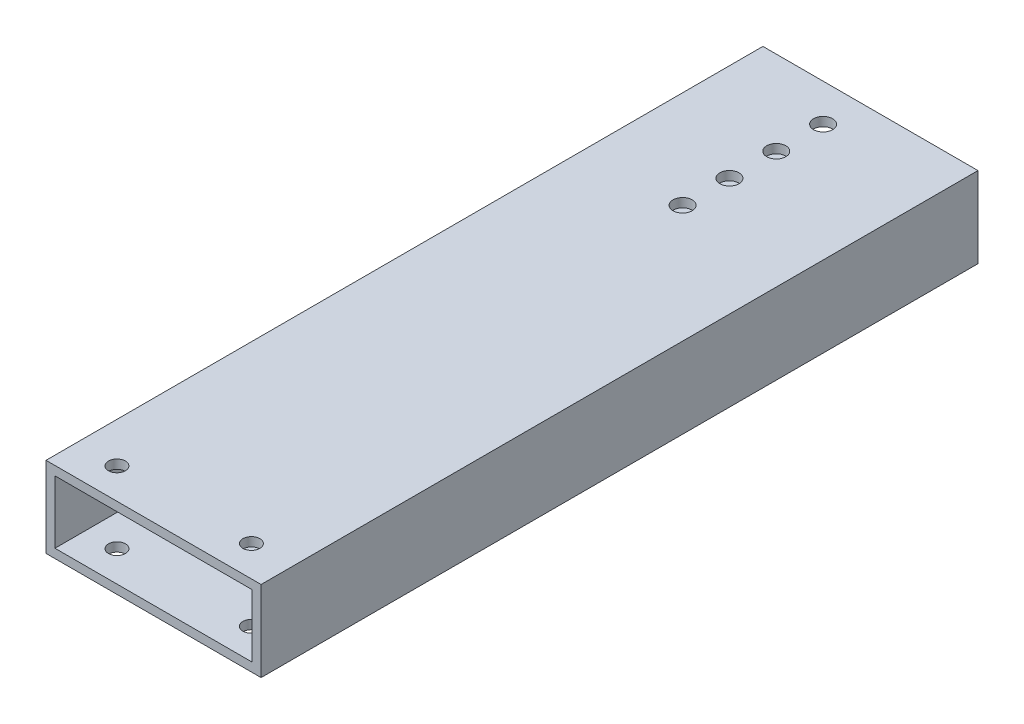
ISO-10303-21;
HEADER;
FILE_DESCRIPTION(('STEP AP214'),'2;1');
FILE_NAME('part.step','',(''),(''),'','','');
FILE_SCHEMA(('AUTOMOTIVE_DESIGN { 1 0 10303 214 1 1 1 1 }'));
ENDSEC;
DATA;
#1=APPLICATION_CONTEXT('core data for automotive mechanical design processes');
#2=APPLICATION_PROTOCOL_DEFINITION('international standard','automotive_design',2000,#1);
#3=PRODUCT_CONTEXT('',#1,'mechanical');
#4=PRODUCT('Part','Part','',(#3));
#5=PRODUCT_RELATED_PRODUCT_CATEGORY('part','',(#4));
#6=PRODUCT_DEFINITION_FORMATION('','',#4);
#7=PRODUCT_DEFINITION_CONTEXT('part definition',#1,'design');
#8=PRODUCT_DEFINITION('design','',#6,#7);
#9=PRODUCT_DEFINITION_SHAPE('','',#8);
#10=(LENGTH_UNIT() NAMED_UNIT(*) SI_UNIT(.MILLI.,.METRE.));
#11=(NAMED_UNIT(*) PLANE_ANGLE_UNIT() SI_UNIT($,.RADIAN.));
#12=(NAMED_UNIT(*) SI_UNIT($,.STERADIAN.) SOLID_ANGLE_UNIT());
#13=UNCERTAINTY_MEASURE_WITH_UNIT(LENGTH_MEASURE(1.E-05),#10,'distance_accuracy_value','');
#14=(GEOMETRIC_REPRESENTATION_CONTEXT(3) GLOBAL_UNCERTAINTY_ASSIGNED_CONTEXT((#13)) GLOBAL_UNIT_ASSIGNED_CONTEXT((#10,
#11,#12)) REPRESENTATION_CONTEXT('',''));
#15=CARTESIAN_POINT('',(0.,0.,0.));
#16=DIRECTION('',(0.,0.,1.));
#17=DIRECTION('',(1.,0.,0.));
#18=AXIS2_PLACEMENT_3D('',#15,#16,#17);
#19=CARTESIAN_POINT('',(3.175,28.575,-254.));
#20=DIRECTION('',(-1.,0.,0.));
#21=DIRECTION('',(0.,0.,1.));
#22=AXIS2_PLACEMENT_3D('',#19,#20,#21);
#23=PLANE('',#22);
#24=DIRECTION('',(0.,0.,-1.));
#25=VECTOR('',#24,1.);
#26=CARTESIAN_POINT('',(3.17500000000003,25.4,0.));
#27=LINE('',#26,#25);
#28=CARTESIAN_POINT('',(3.17500000000003,25.4,0.));
#29=VERTEX_POINT('',#28);
#30=CARTESIAN_POINT('',(3.175,25.4,-254.));
#31=VERTEX_POINT('',#30);
#32=EDGE_CURVE('E114',#29,#31,#27,.T.);
#33=ORIENTED_EDGE('',*,*,#32,.F.);
#34=DIRECTION('',(0.,-1.,0.));
#35=VECTOR('',#34,1.);
#36=CARTESIAN_POINT('',(3.17500000000003,28.575,0.));
#37=LINE('',#36,#35);
#38=CARTESIAN_POINT('',(3.17500000000002,3.175,0.));
#39=VERTEX_POINT('',#38);
#40=EDGE_CURVE('E57',#29,#39,#37,.T.);
#41=ORIENTED_EDGE('',*,*,#40,.T.);
#42=DIRECTION('',(0.,0.,-1.));
#43=VECTOR('',#42,1.);
#44=CARTESIAN_POINT('',(3.175,3.175,-254.));
#45=LINE('',#44,#43);
#46=CARTESIAN_POINT('',(3.175,3.175,-254.));
#47=VERTEX_POINT('',#46);
#48=EDGE_CURVE('E119',#39,#47,#45,.T.);
#49=ORIENTED_EDGE('',*,*,#48,.T.);
#50=DIRECTION('',(0.,-1.,0.));
#51=VECTOR('',#50,1.);
#52=CARTESIAN_POINT('',(3.175,28.575,-254.));
#53=LINE('',#52,#51);
#54=EDGE_CURVE('E108',#31,#47,#53,.T.);
#55=ORIENTED_EDGE('',*,*,#54,.F.);
#56=EDGE_LOOP('',(#33,#41,#49,#55));
#57=FACE_BOUND('',#56,.T.);
#58=ADVANCED_FACE('F32',(#57),#23,.F.);
#59=CARTESIAN_POINT('',(73.025,28.575,0.));
#60=DIRECTION('',(1.,0.,0.));
#61=DIRECTION('',(0.,0.,-1.));
#62=AXIS2_PLACEMENT_3D('',#59,#60,#61);
#63=PLANE('',#62);
#64=DIRECTION('',(0.,0.,-1.));
#65=VECTOR('',#64,1.);
#66=CARTESIAN_POINT('',(73.0249999999728,25.4,-6.14669686828047E-11));
#67=LINE('',#66,#65);
#68=CARTESIAN_POINT('',(73.0250000000865,25.4,0.));
#69=VERTEX_POINT('',#68);
#70=CARTESIAN_POINT('',(73.0250000000865,25.4,-254.));
#71=VERTEX_POINT('',#70);
#72=EDGE_CURVE('E214',#69,#71,#67,.T.);
#73=ORIENTED_EDGE('',*,*,#72,.T.);
#74=DIRECTION('',(0.,-1.,0.));
#75=VECTOR('',#74,1.);
#76=CARTESIAN_POINT('',(73.025,28.575,-254.));
#77=LINE('',#76,#75);
#78=CARTESIAN_POINT('',(73.025,3.175,-254.));
#79=VERTEX_POINT('',#78);
#80=EDGE_CURVE('E110',#71,#79,#77,.T.);
#81=ORIENTED_EDGE('',*,*,#80,.T.);
#82=DIRECTION('',(0.,0.,1.));
#83=VECTOR('',#82,1.);
#84=CARTESIAN_POINT('',(73.025,3.175,0.));
#85=LINE('',#84,#83);
#86=CARTESIAN_POINT('',(73.025,3.175,0.));
#87=VERTEX_POINT('',#86);
#88=EDGE_CURVE('E217',#79,#87,#85,.T.);
#89=ORIENTED_EDGE('',*,*,#88,.T.);
#90=DIRECTION('',(0.,-1.,0.));
#91=VECTOR('',#90,1.);
#92=CARTESIAN_POINT('',(73.025,28.575,0.));
#93=LINE('',#92,#91);
#94=EDGE_CURVE('E49',#69,#87,#93,.T.);
#95=ORIENTED_EDGE('',*,*,#94,.F.);
#96=EDGE_LOOP('',(#73,#81,#89,#95));
#97=FACE_BOUND('',#96,.T.);
#98=ADVANCED_FACE('F251',(#97),#63,.F.);
#99=CARTESIAN_POINT('',(0.,3.175,0.));
#100=DIRECTION('',(0.,-1.,0.));
#101=DIRECTION('',(0.,0.,-1.));
#102=AXIS2_PLACEMENT_3D('',#99,#100,#101);
#103=PLANE('',#102);
#104=CARTESIAN_POINT('',(61.9125,3.175,-10.8525678746556));
#105=DIRECTION('',(0.,-1.,0.));
#106=DIRECTION('',(0.,0.,-1.));
#107=AXIS2_PLACEMENT_3D('',#104,#105,#106);
#108=CIRCLE('',#107,3.00000000000001);
#109=CARTESIAN_POINT('',(61.9125,3.175,-13.8525678746556));
#110=VERTEX_POINT('',#109);
#111=EDGE_CURVE('E180',#110,#110,#108,.T.);
#112=ORIENTED_EDGE('',*,*,#111,.T.);
#113=EDGE_LOOP('',(#112));
#114=FACE_BOUND('',#113,.T.);
#115=CARTESIAN_POINT('',(14.2875,3.175,-10.8525678746556));
#116=DIRECTION('',(0.,-1.,0.));
#117=DIRECTION('',(0.,0.,-1.));
#118=AXIS2_PLACEMENT_3D('',#115,#116,#117);
#119=CIRCLE('',#118,3.);
#120=CARTESIAN_POINT('',(14.2875,3.175,-13.8525678746556));
#121=VERTEX_POINT('',#120);
#122=EDGE_CURVE('E167',#121,#121,#119,.T.);
#123=ORIENTED_EDGE('',*,*,#122,.T.);
#124=EDGE_LOOP('',(#123));
#125=FACE_BOUND('',#124,.T.);
#126=CARTESIAN_POINT('',(34.5312999999985,3.175,-207.60436));
#127=DIRECTION('',(0.,-1.,0.));
#128=DIRECTION('',(0.,0.,-1.));
#129=AXIS2_PLACEMENT_3D('',#126,#127,#128);
#130=CIRCLE('',#129,3.37820000000001);
#131=CARTESIAN_POINT('',(34.5312999999985,3.175,-210.98256));
#132=VERTEX_POINT('',#131);
#133=EDGE_CURVE('E164',#132,#132,#130,.T.);
#134=ORIENTED_EDGE('',*,*,#133,.T.);
#135=EDGE_LOOP('',(#134));
#136=FACE_BOUND('',#135,.T.);
#137=CARTESIAN_POINT('',(34.5312999999985,3.175,-224.19564));
#138=DIRECTION('',(0.,-1.,0.));
#139=DIRECTION('',(0.,0.,-1.));
#140=AXIS2_PLACEMENT_3D('',#137,#138,#139);
#141=CIRCLE('',#140,3.37819999999989);
#142=CARTESIAN_POINT('',(34.5312999999985,3.175,-227.57384));
#143=VERTEX_POINT('',#142);
#144=EDGE_CURVE('E161',#143,#143,#141,.T.);
#145=ORIENTED_EDGE('',*,*,#144,.T.);
#146=EDGE_LOOP('',(#145));
#147=FACE_BOUND('',#146,.T.);
#148=CARTESIAN_POINT('',(34.5312999999985,3.175,-240.78692));
#149=DIRECTION('',(0.,-1.,0.));
#150=DIRECTION('',(0.,0.,-1.));
#151=AXIS2_PLACEMENT_3D('',#148,#149,#150);
#152=CIRCLE('',#151,3.37819999999998);
#153=CARTESIAN_POINT('',(34.5312999999985,3.175,-244.16512));
#154=VERTEX_POINT('',#153);
#155=EDGE_CURVE('E156',#154,#154,#152,.T.);
#156=ORIENTED_EDGE('',*,*,#155,.T.);
#157=EDGE_LOOP('',(#156));
#158=FACE_BOUND('',#157,.T.);
#159=CARTESIAN_POINT('',(34.5312999999985,3.175,-191.01308));
#160=DIRECTION('',(0.,-1.,0.));
#161=DIRECTION('',(0.,0.,-1.));
#162=AXIS2_PLACEMENT_3D('',#159,#160,#161);
#163=CIRCLE('',#162,3.37819999999992);
#164=CARTESIAN_POINT('',(34.5312999999985,3.175,-194.39128));
#165=VERTEX_POINT('',#164);
#166=EDGE_CURVE('E117',#165,#165,#163,.T.);
#167=ORIENTED_EDGE('',*,*,#166,.T.);
#168=EDGE_LOOP('',(#167));
#169=FACE_BOUND('',#168,.T.);
#170=ORIENTED_EDGE('',*,*,#88,.F.);
#171=DIRECTION('',(-1.,0.,0.));
#172=VECTOR('',#171,1.);
#173=CARTESIAN_POINT('',(0.,3.175,-254.));
#174=LINE('',#173,#172);
#175=EDGE_CURVE('E131',#79,#47,#174,.T.);
#176=ORIENTED_EDGE('',*,*,#175,.T.);
#177=ORIENTED_EDGE('',*,*,#48,.F.);
#178=DIRECTION('',(1.,0.,0.));
#179=VECTOR('',#178,1.);
#180=CARTESIAN_POINT('',(0.,3.175,0.));
#181=LINE('',#180,#179);
#182=EDGE_CURVE('E129',#39,#87,#181,.T.);
#183=ORIENTED_EDGE('',*,*,#182,.T.);
#184=EDGE_LOOP('',(#170,#176,#177,#183));
#185=FACE_BOUND('',#184,.T.);
#186=ADVANCED_FACE('F246',(#114,#125,#136,#147,#158,#169,#185),#103,.F.);
#187=CARTESIAN_POINT('',(0.,3.175,0.));
#188=DIRECTION('',(1.,0.,0.));
#189=DIRECTION('',(0.,0.,-1.));
#190=AXIS2_PLACEMENT_3D('',#187,#188,#189);
#191=PLANE('',#190);
#192=DIRECTION('',(0.,0.,1.));
#193=VECTOR('',#192,1.);
#194=CARTESIAN_POINT('',(0.,0.,0.));
#195=LINE('',#194,#193);
#196=CARTESIAN_POINT('',(0.,0.,-254.));
#197=VERTEX_POINT('',#196);
#198=CARTESIAN_POINT('',(0.,0.,0.));
#199=VERTEX_POINT('',#198);
#200=EDGE_CURVE('E122',#197,#199,#195,.T.);
#201=ORIENTED_EDGE('',*,*,#200,.T.);
#202=DIRECTION('',(0.,-1.,0.));
#203=VECTOR('',#202,1.);
#204=CARTESIAN_POINT('',(0.,3.175,0.));
#205=LINE('',#204,#203);
#206=CARTESIAN_POINT('',(0.,28.575,0.));
#207=VERTEX_POINT('',#206);
#208=EDGE_CURVE('E11',#207,#199,#205,.T.);
#209=ORIENTED_EDGE('',*,*,#208,.F.);
#210=DIRECTION('',(0.,0.,1.));
#211=VECTOR('',#210,1.);
#212=CARTESIAN_POINT('',(0.,28.575,-254.));
#213=LINE('',#212,#211);
#214=CARTESIAN_POINT('',(0.,28.575,-254.));
#215=VERTEX_POINT('',#214);
#216=EDGE_CURVE('E225',#215,#207,#213,.T.);
#217=ORIENTED_EDGE('',*,*,#216,.F.);
#218=DIRECTION('',(0.,-1.,0.));
#219=VECTOR('',#218,1.);
#220=CARTESIAN_POINT('',(0.,3.175,-254.));
#221=LINE('',#220,#219);
#222=EDGE_CURVE('E134',#215,#197,#221,.T.);
#223=ORIENTED_EDGE('',*,*,#222,.T.);
#224=EDGE_LOOP('',(#201,#209,#217,#223));
#225=FACE_BOUND('',#224,.T.);
#226=ADVANCED_FACE('F34',(#225),#191,.F.);
#227=CARTESIAN_POINT('',(0.,3.175,0.));
#228=DIRECTION('',(0.,0.,-1.));
#229=DIRECTION('',(-1.,0.,0.));
#230=AXIS2_PLACEMENT_3D('',#227,#228,#229);
#231=PLANE('',#230);
#232=ORIENTED_EDGE('',*,*,#40,.F.);
#233=DIRECTION('',(-1.,0.,0.));
#234=VECTOR('',#233,1.);
#235=CARTESIAN_POINT('',(500000.,25.4,-6.14669686828047E-11));
#236=LINE('',#235,#234);
#237=EDGE_CURVE('E113',#69,#29,#236,.T.);
#238=ORIENTED_EDGE('',*,*,#237,.F.);
#239=ORIENTED_EDGE('',*,*,#94,.T.);
#240=ORIENTED_EDGE('',*,*,#182,.F.);
#241=EDGE_LOOP('',(#232,#238,#239,#240));
#242=FACE_BOUND('',#241,.T.);
#243=DIRECTION('',(1.,0.,0.));
#244=VECTOR('',#243,1.);
#245=CARTESIAN_POINT('',(0.,0.,0.));
#246=LINE('',#245,#244);
#247=CARTESIAN_POINT('',(76.2,0.,0.));
#248=VERTEX_POINT('',#247);
#249=EDGE_CURVE('E137',#199,#248,#246,.T.);
#250=ORIENTED_EDGE('',*,*,#249,.T.);
#251=DIRECTION('',(0.,-1.,0.));
#252=VECTOR('',#251,1.);
#253=CARTESIAN_POINT('',(76.2,3.175,0.));
#254=LINE('',#253,#252);
#255=CARTESIAN_POINT('',(76.2,28.575,0.));
#256=VERTEX_POINT('',#255);
#257=EDGE_CURVE('E41',#256,#248,#254,.T.);
#258=ORIENTED_EDGE('',*,*,#257,.F.);
#259=DIRECTION('',(1.,0.,0.));
#260=VECTOR('',#259,1.);
#261=CARTESIAN_POINT('',(0.,28.575,0.));
#262=LINE('',#261,#260);
#263=EDGE_CURVE('E125',#207,#256,#262,.T.);
#264=ORIENTED_EDGE('',*,*,#263,.F.);
#265=ORIENTED_EDGE('',*,*,#208,.T.);
#266=EDGE_LOOP('',(#250,#258,#264,#265));
#267=FACE_BOUND('',#266,.T.);
#268=ADVANCED_FACE('F235',(#242,#267),#231,.F.);
#269=CARTESIAN_POINT('',(76.2,3.175,0.));
#270=DIRECTION('',(-1.,0.,0.));
#271=DIRECTION('',(0.,0.,1.));
#272=AXIS2_PLACEMENT_3D('',#269,#270,#271);
#273=PLANE('',#272);
#274=DIRECTION('',(0.,0.,-1.));
#275=VECTOR('',#274,1.);
#276=CARTESIAN_POINT('',(76.2,0.,0.));
#277=LINE('',#276,#275);
#278=CARTESIAN_POINT('',(76.2,0.,-254.));
#279=VERTEX_POINT('',#278);
#280=EDGE_CURVE('E139',#248,#279,#277,.T.);
#281=ORIENTED_EDGE('',*,*,#280,.T.);
#282=DIRECTION('',(0.,-1.,0.));
#283=VECTOR('',#282,1.);
#284=CARTESIAN_POINT('',(76.2,3.175,-254.));
#285=LINE('',#284,#283);
#286=CARTESIAN_POINT('',(76.2,28.575,-254.));
#287=VERTEX_POINT('',#286);
#288=EDGE_CURVE('E144',#287,#279,#285,.T.);
#289=ORIENTED_EDGE('',*,*,#288,.F.);
#290=DIRECTION('',(0.,0.,-1.));
#291=VECTOR('',#290,1.);
#292=CARTESIAN_POINT('',(76.2,28.575,0.));
#293=LINE('',#292,#291);
#294=EDGE_CURVE('E218',#256,#287,#293,.T.);
#295=ORIENTED_EDGE('',*,*,#294,.F.);
#296=ORIENTED_EDGE('',*,*,#257,.T.);
#297=EDGE_LOOP('',(#281,#289,#295,#296));
#298=FACE_BOUND('',#297,.T.);
#299=ADVANCED_FACE('F239',(#298),#273,.F.);
#300=CARTESIAN_POINT('',(0.,3.175,-254.));
#301=DIRECTION('',(0.,0.,1.));
#302=DIRECTION('',(1.,0.,0.));
#303=AXIS2_PLACEMENT_3D('',#300,#301,#302);
#304=PLANE('',#303);
#305=DIRECTION('',(-1.,0.,0.));
#306=VECTOR('',#305,1.);
#307=CARTESIAN_POINT('',(500000.,25.4,-254.000000000061));
#308=LINE('',#307,#306);
#309=EDGE_CURVE('E102',#71,#31,#308,.T.);
#310=ORIENTED_EDGE('',*,*,#309,.T.);
#311=ORIENTED_EDGE('',*,*,#54,.T.);
#312=ORIENTED_EDGE('',*,*,#175,.F.);
#313=ORIENTED_EDGE('',*,*,#80,.F.);
#314=EDGE_LOOP('',(#310,#311,#312,#313));
#315=FACE_BOUND('',#314,.T.);
#316=DIRECTION('',(-1.,0.,0.));
#317=VECTOR('',#316,1.);
#318=CARTESIAN_POINT('',(0.,0.,-254.));
#319=LINE('',#318,#317);
#320=EDGE_CURVE('E132',#279,#197,#319,.T.);
#321=ORIENTED_EDGE('',*,*,#320,.T.);
#322=ORIENTED_EDGE('',*,*,#222,.F.);
#323=DIRECTION('',(-1.,0.,0.));
#324=VECTOR('',#323,1.);
#325=CARTESIAN_POINT('',(0.,28.575,-254.));
#326=LINE('',#325,#324);
#327=EDGE_CURVE('E120',#287,#215,#326,.T.);
#328=ORIENTED_EDGE('',*,*,#327,.F.);
#329=ORIENTED_EDGE('',*,*,#288,.T.);
#330=EDGE_LOOP('',(#321,#322,#328,#329));
#331=FACE_BOUND('',#330,.T.);
#332=ADVANCED_FACE('F104',(#315,#331),#304,.F.);
#333=CARTESIAN_POINT('',(0.,0.,0.));
#334=DIRECTION('',(0.,-1.,0.));
#335=DIRECTION('',(0.,0.,-1.));
#336=AXIS2_PLACEMENT_3D('',#333,#334,#335);
#337=PLANE('',#336);
#338=CARTESIAN_POINT('',(61.9125,0.,-10.8525678746556));
#339=DIRECTION('',(0.,1.,0.));
#340=DIRECTION('',(0.,0.,1.));
#341=AXIS2_PLACEMENT_3D('',#338,#339,#340);
#342=CIRCLE('',#341,3.00000000000001);
#343=CARTESIAN_POINT('',(61.9125,0.,-7.85256787465559));
#344=VERTEX_POINT('',#343);
#345=EDGE_CURVE('E477',#344,#344,#342,.T.);
#346=ORIENTED_EDGE('',*,*,#345,.T.);
#347=EDGE_LOOP('',(#346));
#348=FACE_BOUND('',#347,.T.);
#349=CARTESIAN_POINT('',(14.2875,0.,-10.8525678746556));
#350=DIRECTION('',(0.,1.,0.));
#351=DIRECTION('',(0.,0.,1.));
#352=AXIS2_PLACEMENT_3D('',#349,#350,#351);
#353=CIRCLE('',#352,3.);
#354=CARTESIAN_POINT('',(14.2875,0.,-7.8525678746556));
#355=VERTEX_POINT('',#354);
#356=EDGE_CURVE('E168',#355,#355,#353,.T.);
#357=ORIENTED_EDGE('',*,*,#356,.T.);
#358=EDGE_LOOP('',(#357));
#359=FACE_BOUND('',#358,.T.);
#360=CARTESIAN_POINT('',(34.5312999999985,0.,-207.60436));
#361=DIRECTION('',(0.,-1.,0.));
#362=DIRECTION('',(0.,0.,-1.));
#363=AXIS2_PLACEMENT_3D('',#360,#361,#362);
#364=CIRCLE('',#363,3.37820000000001);
#365=CARTESIAN_POINT('',(34.5312999999985,0.,-210.98256));
#366=VERTEX_POINT('',#365);
#367=EDGE_CURVE('E187',#366,#366,#364,.T.);
#368=ORIENTED_EDGE('',*,*,#367,.F.);
#369=EDGE_LOOP('',(#368));
#370=FACE_BOUND('',#369,.T.);
#371=CARTESIAN_POINT('',(34.5312999999985,0.,-224.19564));
#372=DIRECTION('',(0.,-1.,0.));
#373=DIRECTION('',(0.,0.,-1.));
#374=AXIS2_PLACEMENT_3D('',#371,#372,#373);
#375=CIRCLE('',#374,3.37819999999989);
#376=CARTESIAN_POINT('',(34.5312999999985,0.,-227.57384));
#377=VERTEX_POINT('',#376);
#378=EDGE_CURVE('E193',#377,#377,#375,.T.);
#379=ORIENTED_EDGE('',*,*,#378,.F.);
#380=EDGE_LOOP('',(#379));
#381=FACE_BOUND('',#380,.T.);
#382=CARTESIAN_POINT('',(34.5312999999985,0.,-240.78692));
#383=DIRECTION('',(0.,-1.,0.));
#384=DIRECTION('',(0.,0.,-1.));
#385=AXIS2_PLACEMENT_3D('',#382,#383,#384);
#386=CIRCLE('',#385,3.37819999999998);
#387=CARTESIAN_POINT('',(34.5312999999985,0.,-244.16512));
#388=VERTEX_POINT('',#387);
#389=EDGE_CURVE('E172',#388,#388,#386,.T.);
#390=ORIENTED_EDGE('',*,*,#389,.F.);
#391=EDGE_LOOP('',(#390));
#392=FACE_BOUND('',#391,.T.);
#393=CARTESIAN_POINT('',(34.5312999999985,0.,-191.01308));
#394=DIRECTION('',(0.,-1.,0.));
#395=DIRECTION('',(0.,0.,-1.));
#396=AXIS2_PLACEMENT_3D('',#393,#394,#395);
#397=CIRCLE('',#396,3.37819999999992);
#398=CARTESIAN_POINT('',(34.5312999999985,0.,-194.39128));
#399=VERTEX_POINT('',#398);
#400=EDGE_CURVE('E207',#399,#399,#397,.T.);
#401=ORIENTED_EDGE('',*,*,#400,.F.);
#402=EDGE_LOOP('',(#401));
#403=FACE_BOUND('',#402,.T.);
#404=ORIENTED_EDGE('',*,*,#200,.F.);
#405=ORIENTED_EDGE('',*,*,#320,.F.);
#406=ORIENTED_EDGE('',*,*,#280,.F.);
#407=ORIENTED_EDGE('',*,*,#249,.F.);
#408=EDGE_LOOP('',(#404,#405,#406,#407));
#409=FACE_BOUND('',#408,.T.);
#410=ADVANCED_FACE('F243',(#348,#359,#370,#381,#392,#403,#409),#337,.T.);
#411=CARTESIAN_POINT('',(0.,28.575,0.));
#412=DIRECTION('',(0.,1.,0.));
#413=DIRECTION('',(0.,0.,1.));
#414=AXIS2_PLACEMENT_3D('',#411,#412,#413);
#415=PLANE('',#414);
#416=CARTESIAN_POINT('',(61.9125,28.575,-10.8525678746556));
#417=DIRECTION('',(0.,1.,0.));
#418=DIRECTION('',(0.,0.,1.));
#419=AXIS2_PLACEMENT_3D('',#416,#417,#418);
#420=CIRCLE('',#419,3.00000000000001);
#421=CARTESIAN_POINT('',(61.9125,28.575,-7.85256787465559));
#422=VERTEX_POINT('',#421);
#423=EDGE_CURVE('E482',#422,#422,#420,.T.);
#424=ORIENTED_EDGE('',*,*,#423,.F.);
#425=EDGE_LOOP('',(#424));
#426=FACE_BOUND('',#425,.T.);
#427=CARTESIAN_POINT('',(14.2875,28.575,-10.8525678746556));
#428=DIRECTION('',(0.,1.,0.));
#429=DIRECTION('',(0.,0.,1.));
#430=AXIS2_PLACEMENT_3D('',#427,#428,#429);
#431=CIRCLE('',#430,3.);
#432=CARTESIAN_POINT('',(14.2875,28.575,-7.8525678746556));
#433=VERTEX_POINT('',#432);
#434=EDGE_CURVE('E175',#433,#433,#431,.T.);
#435=ORIENTED_EDGE('',*,*,#434,.F.);
#436=EDGE_LOOP('',(#435));
#437=FACE_BOUND('',#436,.T.);
#438=CARTESIAN_POINT('',(34.5312999999985,28.575,-207.60436));
#439=DIRECTION('',(0.,-1.,0.));
#440=DIRECTION('',(0.,0.,-1.));
#441=AXIS2_PLACEMENT_3D('',#438,#439,#440);
#442=CIRCLE('',#441,3.37820000000001);
#443=CARTESIAN_POINT('',(34.5312999999985,28.575,-210.98256));
#444=VERTEX_POINT('',#443);
#445=EDGE_CURVE('E157',#444,#444,#442,.T.);
#446=ORIENTED_EDGE('',*,*,#445,.T.);
#447=EDGE_LOOP('',(#446));
#448=FACE_BOUND('',#447,.T.);
#449=CARTESIAN_POINT('',(34.5312999999985,28.575,-224.19564));
#450=DIRECTION('',(0.,-1.,0.));
#451=DIRECTION('',(0.,0.,-1.));
#452=AXIS2_PLACEMENT_3D('',#449,#450,#451);
#453=CIRCLE('',#452,3.37819999999989);
#454=CARTESIAN_POINT('',(34.5312999999985,28.575,-227.57384));
#455=VERTEX_POINT('',#454);
#456=EDGE_CURVE('E190',#455,#455,#453,.T.);
#457=ORIENTED_EDGE('',*,*,#456,.T.);
#458=EDGE_LOOP('',(#457));
#459=FACE_BOUND('',#458,.T.);
#460=CARTESIAN_POINT('',(34.5312999999985,28.575,-240.78692));
#461=DIRECTION('',(0.,-1.,0.));
#462=DIRECTION('',(0.,0.,-1.));
#463=AXIS2_PLACEMENT_3D('',#460,#461,#462);
#464=CIRCLE('',#463,3.37819999999998);
#465=CARTESIAN_POINT('',(34.5312999999985,28.575,-244.16512));
#466=VERTEX_POINT('',#465);
#467=EDGE_CURVE('E196',#466,#466,#464,.T.);
#468=ORIENTED_EDGE('',*,*,#467,.T.);
#469=EDGE_LOOP('',(#468));
#470=FACE_BOUND('',#469,.T.);
#471=CARTESIAN_POINT('',(34.5312999999985,28.575,-191.01308));
#472=DIRECTION('',(0.,-1.,0.));
#473=DIRECTION('',(0.,0.,-1.));
#474=AXIS2_PLACEMENT_3D('',#471,#472,#473);
#475=CIRCLE('',#474,3.37819999999992);
#476=CARTESIAN_POINT('',(34.5312999999985,28.575,-194.39128));
#477=VERTEX_POINT('',#476);
#478=EDGE_CURVE('E152',#477,#477,#475,.T.);
#479=ORIENTED_EDGE('',*,*,#478,.T.);
#480=EDGE_LOOP('',(#479));
#481=FACE_BOUND('',#480,.T.);
#482=ORIENTED_EDGE('',*,*,#216,.T.);
#483=ORIENTED_EDGE('',*,*,#263,.T.);
#484=ORIENTED_EDGE('',*,*,#294,.T.);
#485=ORIENTED_EDGE('',*,*,#327,.T.);
#486=EDGE_LOOP('',(#482,#483,#484,#485));
#487=FACE_BOUND('',#486,.T.);
#488=ADVANCED_FACE('F231',(#426,#437,#448,#459,#470,#481,#487),#415,.T.);
#489=CARTESIAN_POINT('',(500000.,25.4,-6.14669686828047E-11));
#490=DIRECTION('',(0.,1.,0.));
#491=DIRECTION('',(0.,0.,1.));
#492=AXIS2_PLACEMENT_3D('',#489,#490,#491);
#493=PLANE('',#492);
#494=CARTESIAN_POINT('',(61.9125,25.4,-10.8525678746556));
#495=DIRECTION('',(0.,1.,0.));
#496=DIRECTION('',(0.,0.,1.));
#497=AXIS2_PLACEMENT_3D('',#494,#495,#496);
#498=CIRCLE('',#497,3.00000000000001);
#499=CARTESIAN_POINT('',(61.9125,25.4,-7.85256787465559));
#500=VERTEX_POINT('',#499);
#501=EDGE_CURVE('E36',#500,#500,#498,.T.);
#502=ORIENTED_EDGE('',*,*,#501,.T.);
#503=EDGE_LOOP('',(#502));
#504=FACE_BOUND('',#503,.T.);
#505=CARTESIAN_POINT('',(14.2875,25.4,-10.8525678746556));
#506=DIRECTION('',(0.,1.,0.));
#507=DIRECTION('',(0.,0.,1.));
#508=AXIS2_PLACEMENT_3D('',#505,#506,#507);
#509=CIRCLE('',#508,3.);
#510=CARTESIAN_POINT('',(14.2875,25.4,-7.8525678746556));
#511=VERTEX_POINT('',#510);
#512=EDGE_CURVE('E165',#511,#511,#509,.T.);
#513=ORIENTED_EDGE('',*,*,#512,.T.);
#514=EDGE_LOOP('',(#513));
#515=FACE_BOUND('',#514,.T.);
#516=CARTESIAN_POINT('',(34.5312999999985,25.4,-207.60436));
#517=DIRECTION('',(0.,1.,0.));
#518=DIRECTION('',(0.,0.,1.));
#519=AXIS2_PLACEMENT_3D('',#516,#517,#518);
#520=CIRCLE('',#519,3.37820000000001);
#521=CARTESIAN_POINT('',(34.5312999999985,25.4,-204.22616));
#522=VERTEX_POINT('',#521);
#523=EDGE_CURVE('E162',#522,#522,#520,.T.);
#524=ORIENTED_EDGE('',*,*,#523,.T.);
#525=EDGE_LOOP('',(#524));
#526=FACE_BOUND('',#525,.T.);
#527=CARTESIAN_POINT('',(34.5312999999985,25.4,-224.19564));
#528=DIRECTION('',(0.,1.,0.));
#529=DIRECTION('',(0.,0.,1.));
#530=AXIS2_PLACEMENT_3D('',#527,#528,#529);
#531=CIRCLE('',#530,3.37819999999989);
#532=CARTESIAN_POINT('',(34.5312999999985,25.4,-220.81744));
#533=VERTEX_POINT('',#532);
#534=EDGE_CURVE('E158',#533,#533,#531,.T.);
#535=ORIENTED_EDGE('',*,*,#534,.T.);
#536=EDGE_LOOP('',(#535));
#537=FACE_BOUND('',#536,.T.);
#538=CARTESIAN_POINT('',(34.5312999999985,25.4,-240.78692));
#539=DIRECTION('',(0.,1.,0.));
#540=DIRECTION('',(0.,0.,1.));
#541=AXIS2_PLACEMENT_3D('',#538,#539,#540);
#542=CIRCLE('',#541,3.37819999999998);
#543=CARTESIAN_POINT('',(34.5312999999985,25.4,-237.40872));
#544=VERTEX_POINT('',#543);
#545=EDGE_CURVE('E153',#544,#544,#542,.T.);
#546=ORIENTED_EDGE('',*,*,#545,.T.);
#547=EDGE_LOOP('',(#546));
#548=FACE_BOUND('',#547,.T.);
#549=CARTESIAN_POINT('',(34.5312999999985,25.4,-191.01308));
#550=DIRECTION('',(0.,1.,0.));
#551=DIRECTION('',(0.,0.,1.));
#552=AXIS2_PLACEMENT_3D('',#549,#550,#551);
#553=CIRCLE('',#552,3.37819999999992);
#554=CARTESIAN_POINT('',(34.5312999999985,25.4,-187.63488));
#555=VERTEX_POINT('',#554);
#556=EDGE_CURVE('E149',#555,#555,#553,.T.);
#557=ORIENTED_EDGE('',*,*,#556,.T.);
#558=EDGE_LOOP('',(#557));
#559=FACE_BOUND('',#558,.T.);
#560=ORIENTED_EDGE('',*,*,#72,.F.);
#561=ORIENTED_EDGE('',*,*,#237,.T.);
#562=ORIENTED_EDGE('',*,*,#32,.T.);
#563=ORIENTED_EDGE('',*,*,#309,.F.);
#564=EDGE_LOOP('',(#560,#561,#562,#563));
#565=FACE_BOUND('',#564,.T.);
#566=ADVANCED_FACE('F116',(#504,#515,#526,#537,#548,#559,#565),#493,.F.);
#567=CARTESIAN_POINT('',(34.5312999999985,28.575,-191.01308));
#568=DIRECTION('',(0.,-1.,0.));
#569=DIRECTION('',(0.,0.,-1.));
#570=AXIS2_PLACEMENT_3D('',#567,#568,#569);
#571=CYLINDRICAL_SURFACE('',#570,3.37819999999992);
#572=ORIENTED_EDGE('',*,*,#478,.F.);
#573=EDGE_LOOP('',(#572));
#574=FACE_BOUND('',#573,.T.);
#575=ORIENTED_EDGE('',*,*,#556,.F.);
#576=EDGE_LOOP('',(#575));
#577=FACE_BOUND('',#576,.T.);
#578=ADVANCED_FACE('F295',(#574,#577),#571,.F.);
#579=ORIENTED_EDGE('',*,*,#400,.T.);
#580=EDGE_LOOP('',(#579));
#581=FACE_BOUND('',#580,.T.);
#582=ORIENTED_EDGE('',*,*,#166,.F.);
#583=EDGE_LOOP('',(#582));
#584=FACE_BOUND('',#583,.T.);
#585=ADVANCED_FACE('F303',(#581,#584),#571,.F.);
#586=CARTESIAN_POINT('',(34.5312999999985,28.575,-240.78692));
#587=DIRECTION('',(0.,-1.,0.));
#588=DIRECTION('',(0.,0.,-1.));
#589=AXIS2_PLACEMENT_3D('',#586,#587,#588);
#590=CYLINDRICAL_SURFACE('',#589,3.37819999999998);
#591=ORIENTED_EDGE('',*,*,#467,.F.);
#592=EDGE_LOOP('',(#591));
#593=FACE_BOUND('',#592,.T.);
#594=ORIENTED_EDGE('',*,*,#545,.F.);
#595=EDGE_LOOP('',(#594));
#596=FACE_BOUND('',#595,.T.);
#597=ADVANCED_FACE('F311',(#593,#596),#590,.F.);
#598=CARTESIAN_POINT('',(34.5312999999985,28.575,-224.19564));
#599=DIRECTION('',(0.,-1.,0.));
#600=DIRECTION('',(0.,0.,-1.));
#601=AXIS2_PLACEMENT_3D('',#598,#599,#600);
#602=CYLINDRICAL_SURFACE('',#601,3.37819999999989);
#603=ORIENTED_EDGE('',*,*,#456,.F.);
#604=EDGE_LOOP('',(#603));
#605=FACE_BOUND('',#604,.T.);
#606=ORIENTED_EDGE('',*,*,#534,.F.);
#607=EDGE_LOOP('',(#606));
#608=FACE_BOUND('',#607,.T.);
#609=ADVANCED_FACE('F318',(#605,#608),#602,.F.);
#610=CARTESIAN_POINT('',(34.5312999999985,28.575,-207.60436));
#611=DIRECTION('',(0.,-1.,0.));
#612=DIRECTION('',(0.,0.,-1.));
#613=AXIS2_PLACEMENT_3D('',#610,#611,#612);
#614=CYLINDRICAL_SURFACE('',#613,3.37820000000001);
#615=ORIENTED_EDGE('',*,*,#445,.F.);
#616=EDGE_LOOP('',(#615));
#617=FACE_BOUND('',#616,.T.);
#618=ORIENTED_EDGE('',*,*,#523,.F.);
#619=EDGE_LOOP('',(#618));
#620=FACE_BOUND('',#619,.T.);
#621=ADVANCED_FACE('F327',(#617,#620),#614,.F.);
#622=ORIENTED_EDGE('',*,*,#389,.T.);
#623=EDGE_LOOP('',(#622));
#624=FACE_BOUND('',#623,.T.);
#625=ORIENTED_EDGE('',*,*,#155,.F.);
#626=EDGE_LOOP('',(#625));
#627=FACE_BOUND('',#626,.T.);
#628=ADVANCED_FACE('F321',(#624,#627),#590,.F.);
#629=ORIENTED_EDGE('',*,*,#378,.T.);
#630=EDGE_LOOP('',(#629));
#631=FACE_BOUND('',#630,.T.);
#632=ORIENTED_EDGE('',*,*,#144,.F.);
#633=EDGE_LOOP('',(#632));
#634=FACE_BOUND('',#633,.T.);
#635=ADVANCED_FACE('F330',(#631,#634),#602,.F.);
#636=ORIENTED_EDGE('',*,*,#367,.T.);
#637=EDGE_LOOP('',(#636));
#638=FACE_BOUND('',#637,.T.);
#639=ORIENTED_EDGE('',*,*,#133,.F.);
#640=EDGE_LOOP('',(#639));
#641=FACE_BOUND('',#640,.T.);
#642=ADVANCED_FACE('F338',(#638,#641),#614,.F.);
#643=CARTESIAN_POINT('',(14.2875,0.,-10.8525678746556));
#644=DIRECTION('',(0.,1.,0.));
#645=DIRECTION('',(0.,0.,1.));
#646=AXIS2_PLACEMENT_3D('',#643,#644,#645);
#647=CYLINDRICAL_SURFACE('',#646,3.);
#648=ORIENTED_EDGE('',*,*,#434,.T.);
#649=EDGE_LOOP('',(#648));
#650=FACE_BOUND('',#649,.T.);
#651=ORIENTED_EDGE('',*,*,#512,.F.);
#652=EDGE_LOOP('',(#651));
#653=FACE_BOUND('',#652,.T.);
#654=ADVANCED_FACE('F356',(#650,#653),#647,.F.);
#655=ORIENTED_EDGE('',*,*,#356,.F.);
#656=EDGE_LOOP('',(#655));
#657=FACE_BOUND('',#656,.T.);
#658=ORIENTED_EDGE('',*,*,#122,.F.);
#659=EDGE_LOOP('',(#658));
#660=FACE_BOUND('',#659,.T.);
#661=ADVANCED_FACE('F362',(#657,#660),#647,.F.);
#662=CARTESIAN_POINT('',(61.9125,0.,-10.8525678746556));
#663=DIRECTION('',(0.,1.,0.));
#664=DIRECTION('',(0.,0.,1.));
#665=AXIS2_PLACEMENT_3D('',#662,#663,#664);
#666=CYLINDRICAL_SURFACE('',#665,3.00000000000001);
#667=ORIENTED_EDGE('',*,*,#423,.T.);
#668=EDGE_LOOP('',(#667));
#669=FACE_BOUND('',#668,.T.);
#670=ORIENTED_EDGE('',*,*,#501,.F.);
#671=EDGE_LOOP('',(#670));
#672=FACE_BOUND('',#671,.T.);
#673=ADVANCED_FACE('F370',(#669,#672),#666,.F.);
#674=ORIENTED_EDGE('',*,*,#345,.F.);
#675=EDGE_LOOP('',(#674));
#676=FACE_BOUND('',#675,.T.);
#677=ORIENTED_EDGE('',*,*,#111,.F.);
#678=EDGE_LOOP('',(#677));
#679=FACE_BOUND('',#678,.T.);
#680=ADVANCED_FACE('F377',(#676,#679),#666,.F.);
#681=CLOSED_SHELL('',(#58,#98,#186,#226,#268,#299,#332,#410,#488,#566,#578,#585,#597,#609,#621,
#628,#635,#642,#654,#661,#673,#680));
#682=MANIFOLD_SOLID_BREP('B2',#681);
#683=ADVANCED_BREP_SHAPE_REPRESENTATION('',(#18,#682),#14);
#684=SHAPE_DEFINITION_REPRESENTATION(#9,#683);
ENDSEC;
END-ISO-10303-21;
